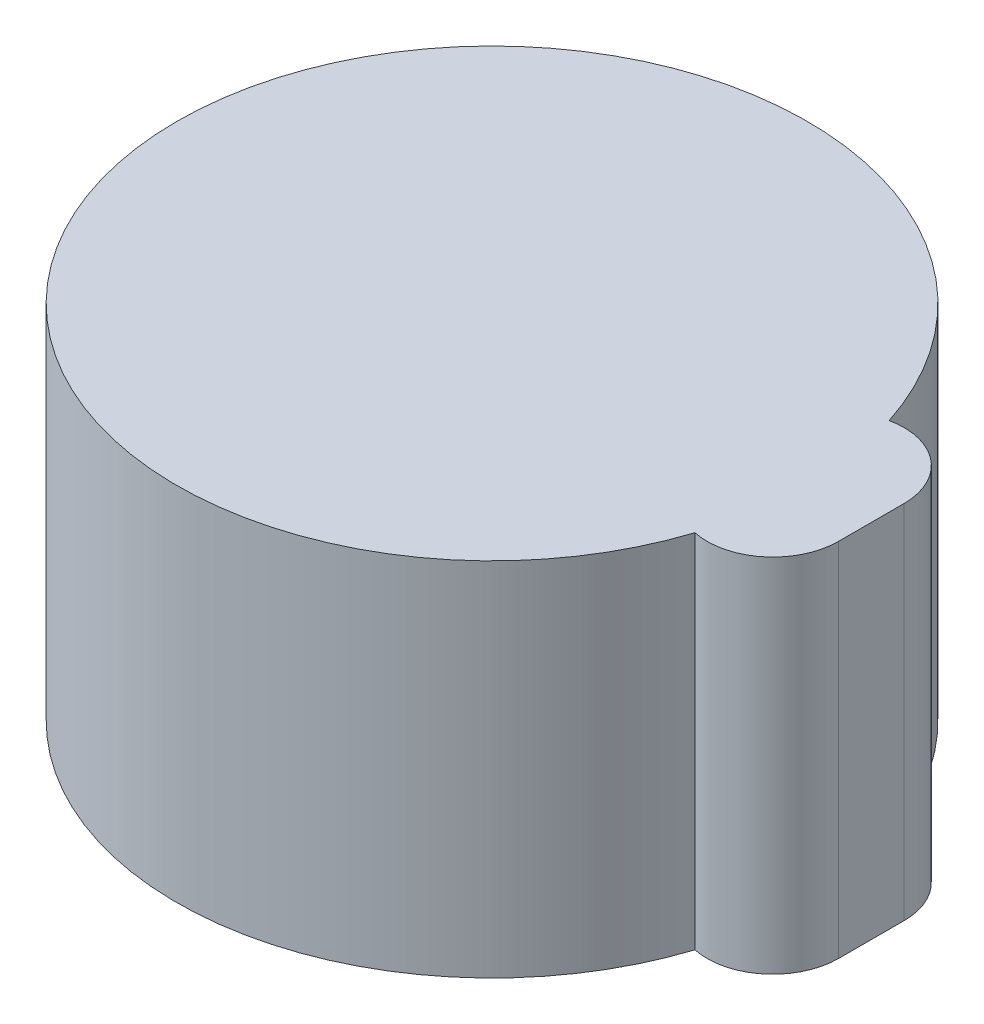
ISO-10303-21;
HEADER;
FILE_DESCRIPTION(('STEP AP214'),'2;1');
FILE_NAME('part.step','',(''),(''),'','','');
FILE_SCHEMA(('AUTOMOTIVE_DESIGN { 1 0 10303 214 1 1 1 1 }'));
ENDSEC;
DATA;
#1=APPLICATION_CONTEXT('core data for automotive mechanical design processes');
#2=APPLICATION_PROTOCOL_DEFINITION('international standard','automotive_design',2000,#1);
#3=PRODUCT_CONTEXT('',#1,'mechanical');
#4=PRODUCT('Part','Part','',(#3));
#5=PRODUCT_RELATED_PRODUCT_CATEGORY('part','',(#4));
#6=PRODUCT_DEFINITION_FORMATION('','',#4);
#7=PRODUCT_DEFINITION_CONTEXT('part definition',#1,'design');
#8=PRODUCT_DEFINITION('design','',#6,#7);
#9=PRODUCT_DEFINITION_SHAPE('','',#8);
#10=(LENGTH_UNIT() NAMED_UNIT(*) SI_UNIT(.MILLI.,.METRE.));
#11=(NAMED_UNIT(*) PLANE_ANGLE_UNIT() SI_UNIT($,.RADIAN.));
#12=(NAMED_UNIT(*) SI_UNIT($,.STERADIAN.) SOLID_ANGLE_UNIT());
#13=UNCERTAINTY_MEASURE_WITH_UNIT(LENGTH_MEASURE(1.E-05),#10,'distance_accuracy_value','');
#14=(GEOMETRIC_REPRESENTATION_CONTEXT(3) GLOBAL_UNCERTAINTY_ASSIGNED_CONTEXT((#13)) GLOBAL_UNIT_ASSIGNED_CONTEXT((#10,
#11,#12)) REPRESENTATION_CONTEXT('',''));
#15=CARTESIAN_POINT('',(0.,0.,0.));
#16=DIRECTION('',(0.,0.,1.));
#17=DIRECTION('',(1.,0.,0.));
#18=AXIS2_PLACEMENT_3D('',#15,#16,#17);
#19=CARTESIAN_POINT('',(5.273887304912,5.,0.));
#20=DIRECTION('',(1.,0.,0.));
#21=DIRECTION('',(0.,0.,-1.));
#22=AXIS2_PLACEMENT_3D('',#19,#20,#21);
#23=PLANE('',#22);
#24=DIRECTION('',(0.,0.,1.));
#25=VECTOR('',#24,1.);
#26=CARTESIAN_POINT('',(5.273887304912,0.,0.));
#27=LINE('',#26,#25);
#28=CARTESIAN_POINT('',(5.273887304912,0.,-0.5));
#29=VERTEX_POINT('',#28);
#30=CARTESIAN_POINT('',(5.273887304912,0.,0.5));
#31=VERTEX_POINT('',#30);
#32=EDGE_CURVE('E188',#29,#31,#27,.T.);
#33=ORIENTED_EDGE('',*,*,#32,.T.);
#34=DIRECTION('',(0.,-1.,0.));
#35=VECTOR('',#34,1.);
#36=CARTESIAN_POINT('',(5.273887304912,5.,0.5));
#37=LINE('',#36,#35);
#38=CARTESIAN_POINT('',(5.273887304912,5.,0.5));
#39=VERTEX_POINT('',#38);
#40=EDGE_CURVE('E11',#39,#31,#37,.T.);
#41=ORIENTED_EDGE('',*,*,#40,.F.);
#42=DIRECTION('',(0.,0.,1.));
#43=VECTOR('',#42,1.);
#44=CARTESIAN_POINT('',(5.273887304912,5.,0.));
#45=LINE('',#44,#43);
#46=CARTESIAN_POINT('',(5.273887304912,5.,-0.5));
#47=VERTEX_POINT('',#46);
#48=EDGE_CURVE('E166',#47,#39,#45,.T.);
#49=ORIENTED_EDGE('',*,*,#48,.F.);
#50=DIRECTION('',(0.,-1.,0.));
#51=VECTOR('',#50,1.);
#52=CARTESIAN_POINT('',(5.273887304912,5.,-0.5));
#53=LINE('',#52,#51);
#54=EDGE_CURVE('E203',#47,#29,#53,.T.);
#55=ORIENTED_EDGE('',*,*,#54,.T.);
#56=EDGE_LOOP('',(#33,#41,#49,#55));
#57=FACE_BOUND('',#56,.T.);
#58=ADVANCED_FACE('F34',(#57),#23,.F.);
#59=CARTESIAN_POINT('',(4.773887304912,5.,0.5));
#60=DIRECTION('',(0.,-1.,0.));
#61=DIRECTION('',(0.,0.,-1.));
#62=AXIS2_PLACEMENT_3D('',#59,#60,#61);
#63=CYLINDRICAL_SURFACE('',#62,0.5);
#64=CARTESIAN_POINT('',(4.773887304912,0.,0.5));
#65=DIRECTION('',(0.,1.,0.));
#66=DIRECTION('',(0.,0.,1.));
#67=AXIS2_PLACEMENT_3D('',#64,#65,#66);
#68=CIRCLE('',#67,0.5);
#69=CARTESIAN_POINT('',(4.69597466586435,0.,0.99389231688358));
#70=VERTEX_POINT('',#69);
#71=EDGE_CURVE('E191',#31,#70,#68,.F.);
#72=ORIENTED_EDGE('',*,*,#71,.T.);
#73=DIRECTION('',(0.,-1.,0.));
#74=VECTOR('',#73,1.);
#75=CARTESIAN_POINT('',(4.69597466586435,5.,0.99389231688358));
#76=LINE('',#75,#74);
#77=CARTESIAN_POINT('',(4.69597466586435,5.,0.99389231688358));
#78=VERTEX_POINT('',#77);
#79=EDGE_CURVE('E43',#78,#70,#76,.T.);
#80=ORIENTED_EDGE('',*,*,#79,.F.);
#81=CARTESIAN_POINT('',(4.773887304912,5.,0.5));
#82=DIRECTION('',(0.,1.,0.));
#83=DIRECTION('',(0.,0.,1.));
#84=AXIS2_PLACEMENT_3D('',#81,#82,#83);
#85=CIRCLE('',#84,0.5);
#86=EDGE_CURVE('E168',#39,#78,#85,.F.);
#87=ORIENTED_EDGE('',*,*,#86,.F.);
#88=ORIENTED_EDGE('',*,*,#40,.T.);
#89=EDGE_LOOP('',(#72,#80,#87,#88));
#90=FACE_BOUND('',#89,.T.);
#91=ADVANCED_FACE('F249',(#90),#63,.F.);
#92=CARTESIAN_POINT('',(0.,5.,0.99389231688358));
#93=DIRECTION('',(0.,0.,1.));
#94=DIRECTION('',(1.,0.,0.));
#95=AXIS2_PLACEMENT_3D('',#92,#93,#94);
#96=PLANE('',#95);
#97=DIRECTION('',(-1.,0.,0.));
#98=VECTOR('',#97,1.);
#99=CARTESIAN_POINT('',(0.,0.,0.99389231688358));
#100=LINE('',#99,#98);
#101=CARTESIAN_POINT('',(4.18356045282482,0.,0.99389231688358));
#102=VERTEX_POINT('',#101);
#103=EDGE_CURVE('E193',#70,#102,#100,.T.);
#104=ORIENTED_EDGE('',*,*,#103,.T.);
#105=DIRECTION('',(0.,-1.,0.));
#106=VECTOR('',#105,1.);
#107=CARTESIAN_POINT('',(4.18356045282482,5.,0.99389231688358));
#108=LINE('',#107,#106);
#109=CARTESIAN_POINT('',(4.18356045282482,4.,0.99389231688358));
#110=VERTEX_POINT('',#109);
#111=EDGE_CURVE('E147',#110,#102,#108,.T.);
#112=ORIENTED_EDGE('',*,*,#111,.F.);
#113=DIRECTION('',(-1.,0.,0.));
#114=VECTOR('',#113,1.);
#115=CARTESIAN_POINT('',(0.,4.,0.99389231688358));
#116=LINE('',#115,#114);
#117=CARTESIAN_POINT('',(3.66772109932582,4.,0.99389231688358));
#118=VERTEX_POINT('',#117);
#119=EDGE_CURVE('E140',#110,#118,#116,.T.);
#120=ORIENTED_EDGE('',*,*,#119,.T.);
#121=DIRECTION('',(0.,1.,0.));
#122=VECTOR('',#121,1.);
#123=CARTESIAN_POINT('',(3.66772109932582,4.,0.99389231688358));
#124=LINE('',#123,#122);
#125=CARTESIAN_POINT('',(3.66772109932582,5.,0.99389231688358));
#126=VERTEX_POINT('',#125);
#127=EDGE_CURVE('E124',#118,#126,#124,.T.);
#128=ORIENTED_EDGE('',*,*,#127,.T.);
#129=DIRECTION('',(-1.,0.,0.));
#130=VECTOR('',#129,1.);
#131=CARTESIAN_POINT('',(0.,5.,0.99389231688358));
#132=LINE('',#131,#130);
#133=EDGE_CURVE('E171',#78,#126,#132,.T.);
#134=ORIENTED_EDGE('',*,*,#133,.F.);
#135=ORIENTED_EDGE('',*,*,#79,.T.);
#136=EDGE_LOOP('',(#104,#112,#120,#128,#134,#135));
#137=FACE_BOUND('',#136,.T.);
#138=ADVANCED_FACE('F146',(#137),#96,.F.);
#139=CARTESIAN_POINT('',(0.,5.,0.));
#140=DIRECTION('',(0.,-1.,0.));
#141=DIRECTION('',(0.,0.,-1.));
#142=AXIS2_PLACEMENT_3D('',#139,#140,#141);
#143=CYLINDRICAL_SURFACE('',#142,4.3);
#144=CARTESIAN_POINT('',(0.,4.,0.));
#145=DIRECTION('',(0.,-1.,0.));
#146=DIRECTION('',(0.,0.,-1.));
#147=AXIS2_PLACEMENT_3D('',#144,#145,#146);
#148=CIRCLE('',#147,4.3);
#149=CARTESIAN_POINT('',(4.18356045282482,4.,-0.99389231688358));
#150=VERTEX_POINT('',#149);
#151=EDGE_CURVE('E51',#110,#150,#148,.T.);
#152=ORIENTED_EDGE('',*,*,#151,.F.);
#153=ORIENTED_EDGE('',*,*,#111,.T.);
#154=CARTESIAN_POINT('',(0.,0.,0.));
#155=DIRECTION('',(0.,1.,0.));
#156=DIRECTION('',(0.,0.,1.));
#157=AXIS2_PLACEMENT_3D('',#154,#155,#156);
#158=CIRCLE('',#157,4.3);
#159=CARTESIAN_POINT('',(4.18356045282482,0.,-0.99389231688358));
#160=VERTEX_POINT('',#159);
#161=EDGE_CURVE('E195',#160,#102,#158,.T.);
#162=ORIENTED_EDGE('',*,*,#161,.F.);
#163=DIRECTION('',(0.,-1.,0.));
#164=VECTOR('',#163,1.);
#165=CARTESIAN_POINT('',(4.18356045282482,5.,-0.99389231688358));
#166=LINE('',#165,#164);
#167=EDGE_CURVE('E56',#150,#160,#166,.T.);
#168=ORIENTED_EDGE('',*,*,#167,.F.);
#169=EDGE_LOOP('',(#152,#153,#162,#168));
#170=FACE_BOUND('',#169,.T.);
#171=ADVANCED_FACE('F270',(#170),#143,.F.);
#172=CARTESIAN_POINT('',(0.,5.,-0.99389231688358));
#173=DIRECTION('',(0.,0.,1.));
#174=DIRECTION('',(1.,0.,0.));
#175=AXIS2_PLACEMENT_3D('',#172,#173,#174);
#176=PLANE('',#175);
#177=DIRECTION('',(-1.,0.,0.));
#178=VECTOR('',#177,1.);
#179=CARTESIAN_POINT('',(0.,0.,-0.99389231688358));
#180=LINE('',#179,#178);
#181=CARTESIAN_POINT('',(4.69597466586435,0.,-0.99389231688358));
#182=VERTEX_POINT('',#181);
#183=EDGE_CURVE('E198',#182,#160,#180,.T.);
#184=ORIENTED_EDGE('',*,*,#183,.F.);
#185=DIRECTION('',(0.,-1.,0.));
#186=VECTOR('',#185,1.);
#187=CARTESIAN_POINT('',(4.69597466586435,5.,-0.99389231688358));
#188=LINE('',#187,#186);
#189=CARTESIAN_POINT('',(4.69597466586435,5.,-0.99389231688358));
#190=VERTEX_POINT('',#189);
#191=EDGE_CURVE('E205',#190,#182,#188,.T.);
#192=ORIENTED_EDGE('',*,*,#191,.F.);
#193=DIRECTION('',(-1.,0.,0.));
#194=VECTOR('',#193,1.);
#195=CARTESIAN_POINT('',(0.,5.,-0.99389231688358));
#196=LINE('',#195,#194);
#197=CARTESIAN_POINT('',(3.66772109932582,5.,-0.99389231688358));
#198=VERTEX_POINT('',#197);
#199=EDGE_CURVE('E173',#190,#198,#196,.T.);
#200=ORIENTED_EDGE('',*,*,#199,.T.);
#201=DIRECTION('',(0.,1.,0.));
#202=VECTOR('',#201,1.);
#203=CARTESIAN_POINT('',(3.66772109932582,4.,-0.99389231688358));
#204=LINE('',#203,#202);
#205=CARTESIAN_POINT('',(3.66772109932582,4.,-0.99389231688358));
#206=VERTEX_POINT('',#205);
#207=EDGE_CURVE('E135',#206,#198,#204,.T.);
#208=ORIENTED_EDGE('',*,*,#207,.F.);
#209=DIRECTION('',(-1.,0.,0.));
#210=VECTOR('',#209,1.);
#211=CARTESIAN_POINT('',(0.,4.,-0.99389231688358));
#212=LINE('',#211,#210);
#213=EDGE_CURVE('E142',#150,#206,#212,.T.);
#214=ORIENTED_EDGE('',*,*,#213,.F.);
#215=ORIENTED_EDGE('',*,*,#167,.T.);
#216=EDGE_LOOP('',(#184,#192,#200,#208,#214,#215));
#217=FACE_BOUND('',#216,.T.);
#218=ADVANCED_FACE('F266',(#217),#176,.T.);
#219=CARTESIAN_POINT('',(4.773887304912,5.,0.5));
#220=DIRECTION('',(0.,-1.,0.));
#221=DIRECTION('',(0.,0.,-1.));
#222=AXIS2_PLACEMENT_3D('',#219,#220,#221);
#223=CYLINDRICAL_SURFACE('',#222,1.);
#224=CARTESIAN_POINT('',(4.773887304912,0.,0.5));
#225=DIRECTION('',(0.,1.,0.));
#226=DIRECTION('',(0.,0.,1.));
#227=AXIS2_PLACEMENT_3D('',#224,#225,#226);
#228=CIRCLE('',#227,1.);
#229=CARTESIAN_POINT('',(4.56668733508075,0.,1.47829861111111));
#230=VERTEX_POINT('',#229);
#231=CARTESIAN_POINT('',(5.773887304912,0.,0.5));
#232=VERTEX_POINT('',#231);
#233=EDGE_CURVE('E165',#230,#232,#228,.T.);
#234=ORIENTED_EDGE('',*,*,#233,.T.);
#235=DIRECTION('',(0.,-1.,0.));
#236=VECTOR('',#235,1.);
#237=CARTESIAN_POINT('',(5.773887304912,5.,0.5));
#238=LINE('',#237,#236);
#239=CARTESIAN_POINT('',(5.773887304912,5.5,0.5));
#240=VERTEX_POINT('',#239);
#241=EDGE_CURVE('E38',#240,#232,#238,.T.);
#242=ORIENTED_EDGE('',*,*,#241,.F.);
#243=CARTESIAN_POINT('',(4.773887304912,5.5,0.5));
#244=DIRECTION('',(0.,1.,0.));
#245=DIRECTION('',(0.,0.,1.));
#246=AXIS2_PLACEMENT_3D('',#243,#244,#245);
#247=CIRCLE('',#246,0.999999999999999);
#248=CARTESIAN_POINT('',(4.56668733508075,5.5,1.47829861111111));
#249=VERTEX_POINT('',#248);
#250=EDGE_CURVE('E156',#249,#240,#247,.T.);
#251=ORIENTED_EDGE('',*,*,#250,.F.);
#252=DIRECTION('',(0.,-1.,0.));
#253=VECTOR('',#252,1.);
#254=CARTESIAN_POINT('',(4.56668733508075,5.,1.47829861111111));
#255=LINE('',#254,#253);
#256=EDGE_CURVE('E178',#249,#230,#255,.T.);
#257=ORIENTED_EDGE('',*,*,#256,.T.);
#258=EDGE_LOOP('',(#234,#242,#251,#257));
#259=FACE_BOUND('',#258,.T.);
#260=ADVANCED_FACE('F36',(#259),#223,.T.);
#261=CARTESIAN_POINT('',(5.773887304912,5.,0.));
#262=DIRECTION('',(1.,0.,0.));
#263=DIRECTION('',(0.,0.,-1.));
#264=AXIS2_PLACEMENT_3D('',#261,#262,#263);
#265=PLANE('',#264);
#266=DIRECTION('',(0.,0.,1.));
#267=VECTOR('',#266,1.);
#268=CARTESIAN_POINT('',(5.773887304912,0.,0.));
#269=LINE('',#268,#267);
#270=CARTESIAN_POINT('',(5.773887304912,0.,-0.5));
#271=VERTEX_POINT('',#270);
#272=EDGE_CURVE('E181',#271,#232,#269,.T.);
#273=ORIENTED_EDGE('',*,*,#272,.F.);
#274=DIRECTION('',(0.,-1.,0.));
#275=VECTOR('',#274,1.);
#276=CARTESIAN_POINT('',(5.773887304912,5.,-0.5));
#277=LINE('',#276,#275);
#278=CARTESIAN_POINT('',(5.773887304912,5.5,-0.5));
#279=VERTEX_POINT('',#278);
#280=EDGE_CURVE('E215',#279,#271,#277,.T.);
#281=ORIENTED_EDGE('',*,*,#280,.F.);
#282=DIRECTION('',(0.,0.,-1.));
#283=VECTOR('',#282,1.);
#284=CARTESIAN_POINT('',(5.773887304912,5.5,0.5));
#285=LINE('',#284,#283);
#286=EDGE_CURVE('E159',#240,#279,#285,.T.);
#287=ORIENTED_EDGE('',*,*,#286,.F.);
#288=ORIENTED_EDGE('',*,*,#241,.T.);
#289=EDGE_LOOP('',(#273,#281,#287,#288));
#290=FACE_BOUND('',#289,.T.);
#291=ADVANCED_FACE('F222',(#290),#265,.T.);
#292=CARTESIAN_POINT('',(4.773887304912,5.,-0.5));
#293=DIRECTION('',(0.,-1.,0.));
#294=DIRECTION('',(0.,0.,-1.));
#295=AXIS2_PLACEMENT_3D('',#292,#293,#294);
#296=CYLINDRICAL_SURFACE('',#295,1.);
#297=CARTESIAN_POINT('',(4.773887304912,0.,-0.5));
#298=DIRECTION('',(0.,1.,0.));
#299=DIRECTION('',(0.,0.,1.));
#300=AXIS2_PLACEMENT_3D('',#297,#298,#299);
#301=CIRCLE('',#300,1.);
#302=CARTESIAN_POINT('',(4.56668733508075,0.,-1.47829861111111));
#303=VERTEX_POINT('',#302);
#304=EDGE_CURVE('E184',#271,#303,#301,.T.);
#305=ORIENTED_EDGE('',*,*,#304,.T.);
#306=DIRECTION('',(0.,-1.,0.));
#307=VECTOR('',#306,1.);
#308=CARTESIAN_POINT('',(4.56668733508075,5.,-1.47829861111111));
#309=LINE('',#308,#307);
#310=CARTESIAN_POINT('',(4.56668733508075,5.5,-1.47829861111111));
#311=VERTEX_POINT('',#310);
#312=EDGE_CURVE('E213',#311,#303,#309,.T.);
#313=ORIENTED_EDGE('',*,*,#312,.F.);
#314=CARTESIAN_POINT('',(4.773887304912,5.5,-0.5));
#315=DIRECTION('',(0.,1.,0.));
#316=DIRECTION('',(0.,0.,1.));
#317=AXIS2_PLACEMENT_3D('',#314,#315,#316);
#318=CIRCLE('',#317,1.);
#319=EDGE_CURVE('E162',#279,#311,#318,.T.);
#320=ORIENTED_EDGE('',*,*,#319,.F.);
#321=ORIENTED_EDGE('',*,*,#280,.T.);
#322=EDGE_LOOP('',(#305,#313,#320,#321));
#323=FACE_BOUND('',#322,.T.);
#324=ADVANCED_FACE('F230',(#323),#296,.T.);
#325=CARTESIAN_POINT('',(0.,5.,0.));
#326=DIRECTION('',(0.,-1.,0.));
#327=DIRECTION('',(0.,0.,-1.));
#328=AXIS2_PLACEMENT_3D('',#325,#326,#327);
#329=CYLINDRICAL_SURFACE('',#328,4.8);
#330=CARTESIAN_POINT('',(0.,0.,0.));
#331=DIRECTION('',(0.,1.,0.));
#332=DIRECTION('',(0.,0.,1.));
#333=AXIS2_PLACEMENT_3D('',#330,#331,#332);
#334=CIRCLE('',#333,4.8);
#335=EDGE_CURVE('E186',#303,#230,#334,.T.);
#336=ORIENTED_EDGE('',*,*,#335,.T.);
#337=ORIENTED_EDGE('',*,*,#256,.F.);
#338=CARTESIAN_POINT('',(0.,5.5,0.));
#339=DIRECTION('',(0.,1.,0.));
#340=DIRECTION('',(0.,0.,1.));
#341=AXIS2_PLACEMENT_3D('',#338,#339,#340);
#342=CIRCLE('',#341,4.8);
#343=EDGE_CURVE('E134',#311,#249,#342,.T.);
#344=ORIENTED_EDGE('',*,*,#343,.F.);
#345=ORIENTED_EDGE('',*,*,#312,.T.);
#346=EDGE_LOOP('',(#336,#337,#344,#345));
#347=FACE_BOUND('',#346,.T.);
#348=ADVANCED_FACE('F233',(#347),#329,.T.);
#349=CARTESIAN_POINT('',(4.773887304912,5.,-0.5));
#350=DIRECTION('',(0.,-1.,0.));
#351=DIRECTION('',(0.,0.,-1.));
#352=AXIS2_PLACEMENT_3D('',#349,#350,#351);
#353=CYLINDRICAL_SURFACE('',#352,0.5);
#354=CARTESIAN_POINT('',(4.773887304912,0.,-0.5));
#355=DIRECTION('',(0.,1.,0.));
#356=DIRECTION('',(0.,0.,1.));
#357=AXIS2_PLACEMENT_3D('',#354,#355,#356);
#358=CIRCLE('',#357,0.5);
#359=EDGE_CURVE('E169',#29,#182,#358,.T.);
#360=ORIENTED_EDGE('',*,*,#359,.F.);
#361=ORIENTED_EDGE('',*,*,#54,.F.);
#362=CARTESIAN_POINT('',(4.773887304912,5.,-0.5));
#363=DIRECTION('',(0.,1.,0.));
#364=DIRECTION('',(0.,0.,1.));
#365=AXIS2_PLACEMENT_3D('',#362,#363,#364);
#366=CIRCLE('',#365,0.5);
#367=EDGE_CURVE('E175',#47,#190,#366,.T.);
#368=ORIENTED_EDGE('',*,*,#367,.T.);
#369=ORIENTED_EDGE('',*,*,#191,.T.);
#370=EDGE_LOOP('',(#360,#361,#368,#369));
#371=FACE_BOUND('',#370,.T.);
#372=ADVANCED_FACE('F245',(#371),#353,.F.);
#373=CARTESIAN_POINT('',(0.,0.,0.));
#374=DIRECTION('',(0.,1.,0.));
#375=DIRECTION('',(0.,0.,1.));
#376=AXIS2_PLACEMENT_3D('',#373,#374,#375);
#377=PLANE('',#376);
#378=ORIENTED_EDGE('',*,*,#233,.F.);
#379=ORIENTED_EDGE('',*,*,#335,.F.);
#380=ORIENTED_EDGE('',*,*,#304,.F.);
#381=ORIENTED_EDGE('',*,*,#272,.T.);
#382=EDGE_LOOP('',(#378,#379,#380,#381));
#383=FACE_BOUND('',#382,.T.);
#384=ORIENTED_EDGE('',*,*,#32,.F.);
#385=ORIENTED_EDGE('',*,*,#359,.T.);
#386=ORIENTED_EDGE('',*,*,#183,.T.);
#387=ORIENTED_EDGE('',*,*,#161,.T.);
#388=ORIENTED_EDGE('',*,*,#103,.F.);
#389=ORIENTED_EDGE('',*,*,#71,.F.);
#390=EDGE_LOOP('',(#384,#385,#386,#387,#388,#389));
#391=FACE_BOUND('',#390,.T.);
#392=ADVANCED_FACE('F228',(#383,#391),#377,.F.);
#393=CARTESIAN_POINT('',(0.,5.5,0.));
#394=DIRECTION('',(0.,1.,0.));
#395=DIRECTION('',(0.,0.,1.));
#396=AXIS2_PLACEMENT_3D('',#393,#394,#395);
#397=PLANE('',#396);
#398=ORIENTED_EDGE('',*,*,#343,.T.);
#399=ORIENTED_EDGE('',*,*,#250,.T.);
#400=ORIENTED_EDGE('',*,*,#286,.T.);
#401=ORIENTED_EDGE('',*,*,#319,.T.);
#402=EDGE_LOOP('',(#398,#399,#400,#401));
#403=FACE_BOUND('',#402,.T.);
#404=ADVANCED_FACE('F235',(#403),#397,.T.);
#405=CARTESIAN_POINT('',(0.,5.,0.));
#406=DIRECTION('',(0.,1.,0.));
#407=DIRECTION('',(0.,0.,1.));
#408=AXIS2_PLACEMENT_3D('',#405,#406,#407);
#409=PLANE('',#408);
#410=ORIENTED_EDGE('',*,*,#133,.T.);
#411=CARTESIAN_POINT('',(0.,5.,0.));
#412=DIRECTION('',(0.,-1.,0.));
#413=DIRECTION('',(0.,0.,-1.));
#414=AXIS2_PLACEMENT_3D('',#411,#412,#413);
#415=CIRCLE('',#414,3.8);
#416=EDGE_CURVE('E130',#126,#198,#415,.T.);
#417=ORIENTED_EDGE('',*,*,#416,.T.);
#418=ORIENTED_EDGE('',*,*,#199,.F.);
#419=ORIENTED_EDGE('',*,*,#367,.F.);
#420=ORIENTED_EDGE('',*,*,#48,.T.);
#421=ORIENTED_EDGE('',*,*,#86,.T.);
#422=EDGE_LOOP('',(#410,#417,#418,#419,#420,#421));
#423=FACE_BOUND('',#422,.T.);
#424=ADVANCED_FACE('F237',(#423),#409,.F.);
#425=CARTESIAN_POINT('',(0.,4.,0.));
#426=DIRECTION('',(0.,1.,0.));
#427=DIRECTION('',(0.,0.,1.));
#428=AXIS2_PLACEMENT_3D('',#425,#426,#427);
#429=CYLINDRICAL_SURFACE('',#428,3.8);
#430=ORIENTED_EDGE('',*,*,#416,.F.);
#431=ORIENTED_EDGE('',*,*,#127,.F.);
#432=CARTESIAN_POINT('',(0.,4.,0.));
#433=DIRECTION('',(0.,-1.,0.));
#434=DIRECTION('',(0.,0.,-1.));
#435=AXIS2_PLACEMENT_3D('',#432,#433,#434);
#436=CIRCLE('',#435,3.8);
#437=EDGE_CURVE('E128',#118,#206,#436,.T.);
#438=ORIENTED_EDGE('',*,*,#437,.T.);
#439=ORIENTED_EDGE('',*,*,#207,.T.);
#440=EDGE_LOOP('',(#430,#431,#438,#439));
#441=FACE_BOUND('',#440,.T.);
#442=ADVANCED_FACE('F126',(#441),#429,.F.);
#443=CARTESIAN_POINT('',(0.,4.,0.));
#444=DIRECTION('',(0.,-1.,0.));
#445=DIRECTION('',(0.,0.,-1.));
#446=AXIS2_PLACEMENT_3D('',#443,#444,#445);
#447=PLANE('',#446);
#448=ORIENTED_EDGE('',*,*,#437,.F.);
#449=ORIENTED_EDGE('',*,*,#119,.F.);
#450=ORIENTED_EDGE('',*,*,#151,.T.);
#451=ORIENTED_EDGE('',*,*,#213,.T.);
#452=EDGE_LOOP('',(#448,#449,#450,#451));
#453=FACE_BOUND('',#452,.T.);
#454=ADVANCED_FACE('F139',(#453),#447,.T.);
#455=CLOSED_SHELL('',(#58,#91,#138,#171,#218,#260,#291,#324,#348,#372,#392,#404,#424,#442,#454));
#456=MANIFOLD_SOLID_BREP('B2',#455);
#457=ADVANCED_BREP_SHAPE_REPRESENTATION('',(#18,#456),#14);
#458=SHAPE_DEFINITION_REPRESENTATION(#9,#457);
ENDSEC;
END-ISO-10303-21;
